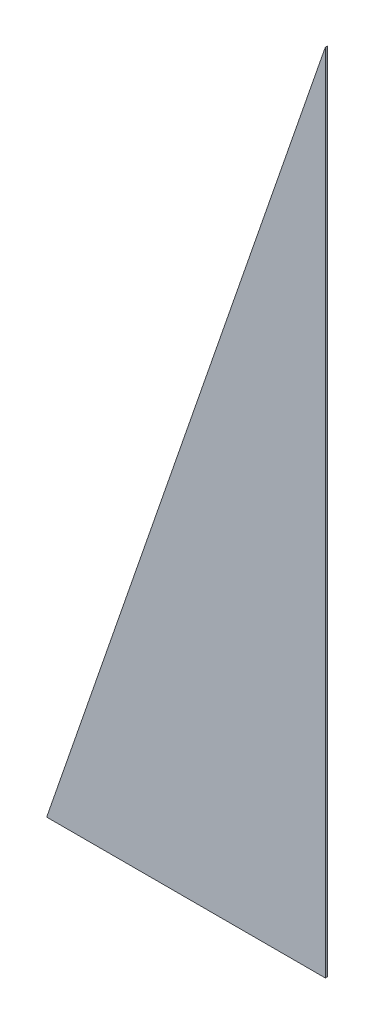
ISO-10303-21;
HEADER;
FILE_DESCRIPTION(('STEP AP214'),'2;1');
FILE_NAME('part.step','',(''),(''),'','','');
FILE_SCHEMA(('AUTOMOTIVE_DESIGN { 1 0 10303 214 1 1 1 1 }'));
ENDSEC;
DATA;
#1=APPLICATION_CONTEXT('core data for automotive mechanical design processes');
#2=APPLICATION_PROTOCOL_DEFINITION('international standard','automotive_design',2000,#1);
#3=PRODUCT_CONTEXT('',#1,'mechanical');
#4=PRODUCT('Part','Part','',(#3));
#5=PRODUCT_RELATED_PRODUCT_CATEGORY('part','',(#4));
#6=PRODUCT_DEFINITION_FORMATION('','',#4);
#7=PRODUCT_DEFINITION_CONTEXT('part definition',#1,'design');
#8=PRODUCT_DEFINITION('design','',#6,#7);
#9=PRODUCT_DEFINITION_SHAPE('','',#8);
#10=(LENGTH_UNIT() NAMED_UNIT(*) SI_UNIT(.MILLI.,.METRE.));
#11=(NAMED_UNIT(*) PLANE_ANGLE_UNIT() SI_UNIT($,.RADIAN.));
#12=(NAMED_UNIT(*) SI_UNIT($,.STERADIAN.) SOLID_ANGLE_UNIT());
#13=UNCERTAINTY_MEASURE_WITH_UNIT(LENGTH_MEASURE(1.E-05),#10,'distance_accuracy_value','');
#14=(GEOMETRIC_REPRESENTATION_CONTEXT(3) GLOBAL_UNCERTAINTY_ASSIGNED_CONTEXT((#13)) GLOBAL_UNIT_ASSIGNED_CONTEXT((#10,
#11,#12)) REPRESENTATION_CONTEXT('',''));
#15=CARTESIAN_POINT('',(0.,0.,0.));
#16=DIRECTION('',(0.,0.,1.));
#17=DIRECTION('',(1.,0.,0.));
#18=AXIS2_PLACEMENT_3D('',#15,#16,#17);
#19=CARTESIAN_POINT('',(-355.6,0.,2.54));
#20=DIRECTION('',(0.,1.,0.));
#21=DIRECTION('',(0.,0.,1.));
#22=AXIS2_PLACEMENT_3D('',#19,#20,#21);
#23=PLANE('',#22);
#24=DIRECTION('',(1.,0.,0.));
#25=VECTOR('',#24,1.);
#26=CARTESIAN_POINT('',(-355.6,0.,0.));
#27=LINE('',#26,#25);
#28=CARTESIAN_POINT('',(-355.6,0.,0.));
#29=VERTEX_POINT('',#28);
#30=CARTESIAN_POINT('',(0.,0.,0.));
#31=VERTEX_POINT('',#30);
#32=EDGE_CURVE('E82',#29,#31,#27,.T.);
#33=ORIENTED_EDGE('',*,*,#32,.T.);
#34=DIRECTION('',(0.,0.,-1.));
#35=VECTOR('',#34,1.);
#36=CARTESIAN_POINT('',(0.,0.,2.54));
#37=LINE('',#36,#35);
#38=CARTESIAN_POINT('',(0.,0.,2.54));
#39=VERTEX_POINT('',#38);
#40=EDGE_CURVE('E11',#39,#31,#37,.T.);
#41=ORIENTED_EDGE('',*,*,#40,.F.);
#42=DIRECTION('',(1.,0.,0.));
#43=VECTOR('',#42,1.);
#44=CARTESIAN_POINT('',(-355.6,0.,2.54));
#45=LINE('',#44,#43);
#46=CARTESIAN_POINT('',(-355.6,0.,2.54));
#47=VERTEX_POINT('',#46);
#48=EDGE_CURVE('E75',#47,#39,#45,.T.);
#49=ORIENTED_EDGE('',*,*,#48,.F.);
#50=DIRECTION('',(0.,0.,-1.));
#51=VECTOR('',#50,1.);
#52=CARTESIAN_POINT('',(-355.6,0.,2.54));
#53=LINE('',#52,#51);
#54=EDGE_CURVE('E83',#47,#29,#53,.T.);
#55=ORIENTED_EDGE('',*,*,#54,.T.);
#56=EDGE_LOOP('',(#33,#41,#49,#55));
#57=FACE_BOUND('',#56,.T.);
#58=ADVANCED_FACE('F35',(#57),#23,.F.);
#59=CARTESIAN_POINT('',(0.,0.,2.54));
#60=DIRECTION('',(-1.,0.,0.));
#61=DIRECTION('',(0.,0.,1.));
#62=AXIS2_PLACEMENT_3D('',#59,#60,#61);
#63=PLANE('',#62);
#64=DIRECTION('',(0.,1.,0.));
#65=VECTOR('',#64,1.);
#66=CARTESIAN_POINT('',(0.,0.,0.));
#67=LINE('',#66,#65);
#68=CARTESIAN_POINT('',(0.,1028.7,0.));
#69=VERTEX_POINT('',#68);
#70=EDGE_CURVE('E63',#31,#69,#67,.T.);
#71=ORIENTED_EDGE('',*,*,#70,.T.);
#72=DIRECTION('',(0.,0.,-1.));
#73=VECTOR('',#72,1.);
#74=CARTESIAN_POINT('',(0.,1028.7,2.54));
#75=LINE('',#74,#73);
#76=CARTESIAN_POINT('',(0.,1028.7,2.54));
#77=VERTEX_POINT('',#76);
#78=EDGE_CURVE('E43',#77,#69,#75,.T.);
#79=ORIENTED_EDGE('',*,*,#78,.F.);
#80=DIRECTION('',(0.,1.,0.));
#81=VECTOR('',#80,1.);
#82=CARTESIAN_POINT('',(0.,0.,2.54));
#83=LINE('',#82,#81);
#84=EDGE_CURVE('E71',#39,#77,#83,.T.);
#85=ORIENTED_EDGE('',*,*,#84,.F.);
#86=ORIENTED_EDGE('',*,*,#40,.T.);
#87=EDGE_LOOP('',(#71,#79,#85,#86));
#88=FACE_BOUND('',#87,.T.);
#89=ADVANCED_FACE('F72',(#88),#63,.F.);
#90=CARTESIAN_POINT('',(0.,1028.7,2.54));
#91=DIRECTION('',(0.945124712183162,-0.32670977705097,0.));
#92=DIRECTION('',(0.32670977705097,0.945124712183163,0.));
#93=AXIS2_PLACEMENT_3D('',#90,#91,#92);
#94=PLANE('',#93);
#95=DIRECTION('',(-0.32670977705097,-0.945124712183162,0.));
#96=VECTOR('',#95,1.);
#97=CARTESIAN_POINT('',(0.,1028.7,0.));
#98=LINE('',#97,#96);
#99=EDGE_CURVE('E68',#69,#29,#98,.T.);
#100=ORIENTED_EDGE('',*,*,#99,.T.);
#101=ORIENTED_EDGE('',*,*,#54,.F.);
#102=DIRECTION('',(-0.32670977705097,-0.945124712183162,0.));
#103=VECTOR('',#102,1.);
#104=CARTESIAN_POINT('',(0.,1028.7,2.54));
#105=LINE('',#104,#103);
#106=EDGE_CURVE('E51',#77,#47,#105,.T.);
#107=ORIENTED_EDGE('',*,*,#106,.F.);
#108=ORIENTED_EDGE('',*,*,#78,.T.);
#109=EDGE_LOOP('',(#100,#101,#107,#108));
#110=FACE_BOUND('',#109,.T.);
#111=ADVANCED_FACE('F90',(#110),#94,.F.);
#112=CARTESIAN_POINT('',(0.,0.,2.54));
#113=DIRECTION('',(0.,0.,1.));
#114=DIRECTION('',(1.,0.,0.));
#115=AXIS2_PLACEMENT_3D('',#112,#113,#114);
#116=PLANE('',#115);
#117=ORIENTED_EDGE('',*,*,#48,.T.);
#118=ORIENTED_EDGE('',*,*,#84,.T.);
#119=ORIENTED_EDGE('',*,*,#106,.T.);
#120=EDGE_LOOP('',(#117,#118,#119));
#121=FACE_BOUND('',#120,.T.);
#122=ADVANCED_FACE('F78',(#121),#116,.T.);
#123=CARTESIAN_POINT('',(0.,0.,0.));
#124=DIRECTION('',(0.,0.,1.));
#125=DIRECTION('',(1.,0.,0.));
#126=AXIS2_PLACEMENT_3D('',#123,#124,#125);
#127=PLANE('',#126);
#128=ORIENTED_EDGE('',*,*,#32,.F.);
#129=ORIENTED_EDGE('',*,*,#99,.F.);
#130=ORIENTED_EDGE('',*,*,#70,.F.);
#131=EDGE_LOOP('',(#128,#129,#130));
#132=FACE_BOUND('',#131,.T.);
#133=ADVANCED_FACE('F91',(#132),#127,.F.);
#134=CLOSED_SHELL('',(#58,#89,#111,#122,#133));
#135=MANIFOLD_SOLID_BREP('B2',#134);
#136=ADVANCED_BREP_SHAPE_REPRESENTATION('',(#18,#135),#14);
#137=SHAPE_DEFINITION_REPRESENTATION(#9,#136);
ENDSEC;
END-ISO-10303-21;
